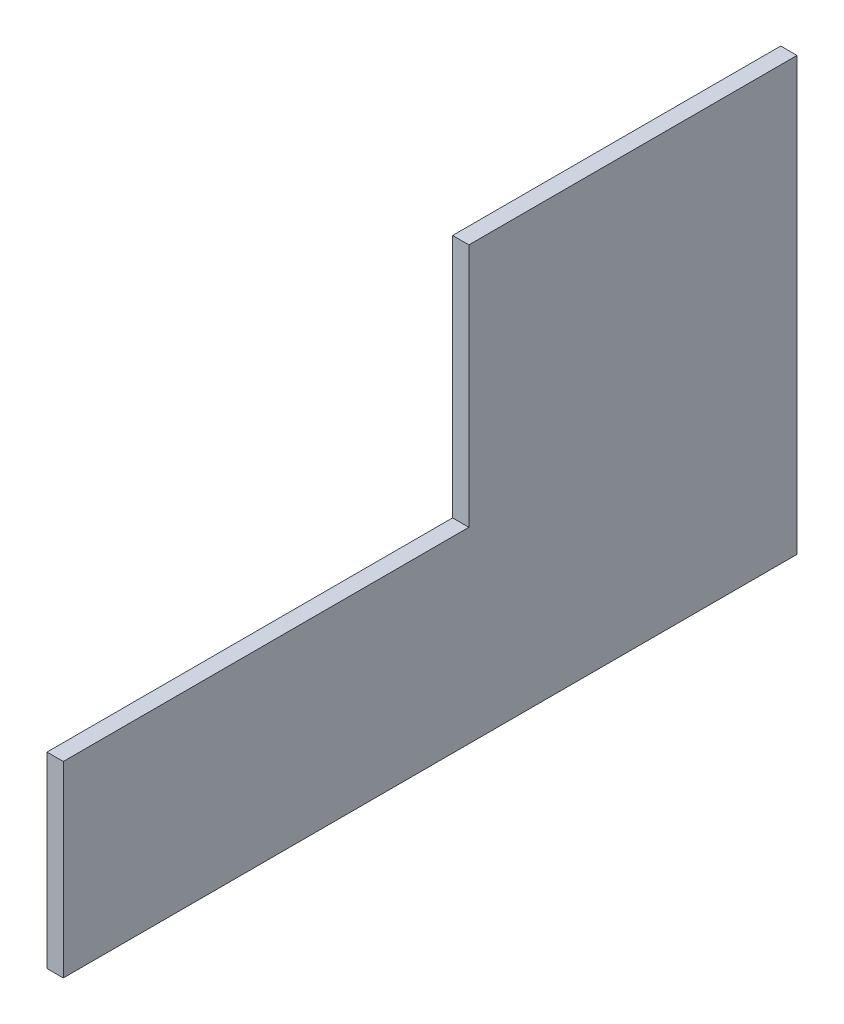
ISO-10303-21;
HEADER;
FILE_DESCRIPTION(('STEP AP214'),'2;1');
FILE_NAME('part.step','',(''),(''),'','','');
FILE_SCHEMA(('AUTOMOTIVE_DESIGN { 1 0 10303 214 1 1 1 1 }'));
ENDSEC;
DATA;
#1=APPLICATION_CONTEXT('core data for automotive mechanical design processes');
#2=APPLICATION_PROTOCOL_DEFINITION('international standard','automotive_design',2000,#1);
#3=PRODUCT_CONTEXT('',#1,'mechanical');
#4=PRODUCT('Part','Part','',(#3));
#5=PRODUCT_RELATED_PRODUCT_CATEGORY('part','',(#4));
#6=PRODUCT_DEFINITION_FORMATION('','',#4);
#7=PRODUCT_DEFINITION_CONTEXT('part definition',#1,'design');
#8=PRODUCT_DEFINITION('design','',#6,#7);
#9=PRODUCT_DEFINITION_SHAPE('','',#8);
#10=(LENGTH_UNIT() NAMED_UNIT(*) SI_UNIT(.MILLI.,.METRE.));
#11=(NAMED_UNIT(*) PLANE_ANGLE_UNIT() SI_UNIT($,.RADIAN.));
#12=(NAMED_UNIT(*) SI_UNIT($,.STERADIAN.) SOLID_ANGLE_UNIT());
#13=UNCERTAINTY_MEASURE_WITH_UNIT(LENGTH_MEASURE(1.E-05),#10,'distance_accuracy_value','');
#14=(GEOMETRIC_REPRESENTATION_CONTEXT(3) GLOBAL_UNCERTAINTY_ASSIGNED_CONTEXT((#13)) GLOBAL_UNIT_ASSIGNED_CONTEXT((#10,
#11,#12)) REPRESENTATION_CONTEXT('',''));
#15=CARTESIAN_POINT('',(0.,0.,0.));
#16=DIRECTION('',(0.,0.,1.));
#17=DIRECTION('',(1.,0.,0.));
#18=AXIS2_PLACEMENT_3D('',#15,#16,#17);
#19=CARTESIAN_POINT('',(-4.,-53.,0.));
#20=DIRECTION('',(0.,-1.,0.));
#21=DIRECTION('',(0.,0.,-1.));
#22=AXIS2_PLACEMENT_3D('',#19,#20,#21);
#23=PLANE('',#22);
#24=DIRECTION('',(0.,0.,-1.));
#25=VECTOR('',#24,1.);
#26=CARTESIAN_POINT('',(0.,-53.,0.));
#27=LINE('',#26,#25);
#28=CARTESIAN_POINT('',(0.,-53.,90.));
#29=VERTEX_POINT('',#28);
#30=CARTESIAN_POINT('',(0.,-53.,-90.));
#31=VERTEX_POINT('',#30);
#32=EDGE_CURVE('E123',#29,#31,#27,.T.);
#33=ORIENTED_EDGE('',*,*,#32,.F.);
#34=DIRECTION('',(1.,0.,0.));
#35=VECTOR('',#34,1.);
#36=CARTESIAN_POINT('',(-4.,-53.,90.));
#37=LINE('',#36,#35);
#38=CARTESIAN_POINT('',(-4.,-53.,90.));
#39=VERTEX_POINT('',#38);
#40=EDGE_CURVE('E12',#39,#29,#37,.T.);
#41=ORIENTED_EDGE('',*,*,#40,.F.);
#42=DIRECTION('',(0.,0.,-1.));
#43=VECTOR('',#42,1.);
#44=CARTESIAN_POINT('',(-4.,-53.,0.));
#45=LINE('',#44,#43);
#46=CARTESIAN_POINT('',(-4.,-53.,-90.));
#47=VERTEX_POINT('',#46);
#48=EDGE_CURVE('E144',#39,#47,#45,.T.);
#49=ORIENTED_EDGE('',*,*,#48,.T.);
#50=DIRECTION('',(1.,0.,0.));
#51=VECTOR('',#50,1.);
#52=CARTESIAN_POINT('',(-4.,-53.,-90.));
#53=LINE('',#52,#51);
#54=EDGE_CURVE('E44',#47,#31,#53,.T.);
#55=ORIENTED_EDGE('',*,*,#54,.T.);
#56=EDGE_LOOP('',(#33,#41,#49,#55));
#57=FACE_BOUND('',#56,.T.);
#58=ADVANCED_FACE('F41',(#57),#23,.T.);
#59=CARTESIAN_POINT('',(-4.,0.,90.));
#60=DIRECTION('',(0.,0.,1.));
#61=DIRECTION('',(1.,0.,0.));
#62=AXIS2_PLACEMENT_3D('',#59,#60,#61);
#63=PLANE('',#62);
#64=DIRECTION('',(0.,-1.,0.));
#65=VECTOR('',#64,1.);
#66=CARTESIAN_POINT('',(0.,0.,90.));
#67=LINE('',#66,#65);
#68=CARTESIAN_POINT('',(0.,-7.00000000000002,90.));
#69=VERTEX_POINT('',#68);
#70=EDGE_CURVE('E141',#69,#29,#67,.T.);
#71=ORIENTED_EDGE('',*,*,#70,.F.);
#72=DIRECTION('',(1.,0.,0.));
#73=VECTOR('',#72,1.);
#74=CARTESIAN_POINT('',(-4.,-7.00000000000002,90.));
#75=LINE('',#74,#73);
#76=CARTESIAN_POINT('',(-4.,-7.00000000000002,90.));
#77=VERTEX_POINT('',#76);
#78=EDGE_CURVE('E50',#77,#69,#75,.T.);
#79=ORIENTED_EDGE('',*,*,#78,.F.);
#80=DIRECTION('',(0.,-1.,0.));
#81=VECTOR('',#80,1.);
#82=CARTESIAN_POINT('',(-4.,0.,90.));
#83=LINE('',#82,#81);
#84=EDGE_CURVE('E105',#77,#39,#83,.T.);
#85=ORIENTED_EDGE('',*,*,#84,.T.);
#86=ORIENTED_EDGE('',*,*,#40,.T.);
#87=EDGE_LOOP('',(#71,#79,#85,#86));
#88=FACE_BOUND('',#87,.T.);
#89=ADVANCED_FACE('F157',(#88),#63,.T.);
#90=CARTESIAN_POINT('',(-4.,-7.00000000000002,0.));
#91=DIRECTION('',(0.,-1.,0.));
#92=DIRECTION('',(0.,0.,-1.));
#93=AXIS2_PLACEMENT_3D('',#90,#91,#92);
#94=PLANE('',#93);
#95=DIRECTION('',(0.,0.,-1.));
#96=VECTOR('',#95,1.);
#97=CARTESIAN_POINT('',(0.,-7.00000000000002,0.));
#98=LINE('',#97,#96);
#99=CARTESIAN_POINT('',(0.,-7.00000000000002,-9.50000000000004));
#100=VERTEX_POINT('',#99);
#101=EDGE_CURVE('E109',#69,#100,#98,.T.);
#102=ORIENTED_EDGE('',*,*,#101,.T.);
#103=DIRECTION('',(1.,0.,0.));
#104=VECTOR('',#103,1.);
#105=CARTESIAN_POINT('',(-4.,-7.00000000000002,-9.50000000000004));
#106=LINE('',#105,#104);
#107=CARTESIAN_POINT('',(-4.,-7.00000000000002,-9.50000000000004));
#108=VERTEX_POINT('',#107);
#109=EDGE_CURVE('E107',#108,#100,#106,.T.);
#110=ORIENTED_EDGE('',*,*,#109,.F.);
#111=DIRECTION('',(0.,0.,-1.));
#112=VECTOR('',#111,1.);
#113=CARTESIAN_POINT('',(-4.,-7.00000000000002,0.));
#114=LINE('',#113,#112);
#115=EDGE_CURVE('E100',#77,#108,#114,.T.);
#116=ORIENTED_EDGE('',*,*,#115,.F.);
#117=ORIENTED_EDGE('',*,*,#78,.T.);
#118=EDGE_LOOP('',(#102,#110,#116,#117));
#119=FACE_BOUND('',#118,.T.);
#120=ADVANCED_FACE('F108',(#119),#94,.F.);
#121=CARTESIAN_POINT('',(-4.,0.,-9.50000000000003));
#122=DIRECTION('',(0.,0.,1.));
#123=DIRECTION('',(0.,-1.,0.));
#124=AXIS2_PLACEMENT_3D('',#121,#122,#123);
#125=PLANE('',#124);
#126=DIRECTION('',(0.,-1.,0.));
#127=VECTOR('',#126,1.);
#128=CARTESIAN_POINT('',(0.,0.,-9.50000000000003));
#129=LINE('',#128,#127);
#130=CARTESIAN_POINT('',(0.,53.,-9.50000000000001));
#131=VERTEX_POINT('',#130);
#132=EDGE_CURVE('E137',#131,#100,#129,.T.);
#133=ORIENTED_EDGE('',*,*,#132,.F.);
#134=DIRECTION('',(1.,0.,0.));
#135=VECTOR('',#134,1.);
#136=CARTESIAN_POINT('',(-4.,53.,-9.50000000000001));
#137=LINE('',#136,#135);
#138=CARTESIAN_POINT('',(-4.,53.,-9.50000000000001));
#139=VERTEX_POINT('',#138);
#140=EDGE_CURVE('E113',#139,#131,#137,.T.);
#141=ORIENTED_EDGE('',*,*,#140,.F.);
#142=DIRECTION('',(0.,-1.,0.));
#143=VECTOR('',#142,1.);
#144=CARTESIAN_POINT('',(-4.,0.,-9.50000000000003));
#145=LINE('',#144,#143);
#146=EDGE_CURVE('E104',#139,#108,#145,.T.);
#147=ORIENTED_EDGE('',*,*,#146,.T.);
#148=ORIENTED_EDGE('',*,*,#109,.T.);
#149=EDGE_LOOP('',(#133,#141,#147,#148));
#150=FACE_BOUND('',#149,.T.);
#151=ADVANCED_FACE('F115',(#150),#125,.T.);
#152=CARTESIAN_POINT('',(-4.,53.,0.));
#153=DIRECTION('',(0.,-1.,0.));
#154=DIRECTION('',(0.,0.,-1.));
#155=AXIS2_PLACEMENT_3D('',#152,#153,#154);
#156=PLANE('',#155);
#157=DIRECTION('',(0.,0.,-1.));
#158=VECTOR('',#157,1.);
#159=CARTESIAN_POINT('',(0.,53.,0.));
#160=LINE('',#159,#158);
#161=CARTESIAN_POINT('',(0.,53.,-90.));
#162=VERTEX_POINT('',#161);
#163=EDGE_CURVE('E135',#131,#162,#160,.T.);
#164=ORIENTED_EDGE('',*,*,#163,.T.);
#165=DIRECTION('',(1.,0.,0.));
#166=VECTOR('',#165,1.);
#167=CARTESIAN_POINT('',(-4.,53.,-90.));
#168=LINE('',#167,#166);
#169=CARTESIAN_POINT('',(-4.,53.,-90.));
#170=VERTEX_POINT('',#169);
#171=EDGE_CURVE('E147',#170,#162,#168,.T.);
#172=ORIENTED_EDGE('',*,*,#171,.F.);
#173=DIRECTION('',(0.,0.,-1.));
#174=VECTOR('',#173,1.);
#175=CARTESIAN_POINT('',(-4.,53.,0.));
#176=LINE('',#175,#174);
#177=EDGE_CURVE('E117',#139,#170,#176,.T.);
#178=ORIENTED_EDGE('',*,*,#177,.F.);
#179=ORIENTED_EDGE('',*,*,#140,.T.);
#180=EDGE_LOOP('',(#164,#172,#178,#179));
#181=FACE_BOUND('',#180,.T.);
#182=ADVANCED_FACE('F170',(#181),#156,.F.);
#183=CARTESIAN_POINT('',(-4.,0.,-90.));
#184=DIRECTION('',(0.,0.,1.));
#185=DIRECTION('',(1.,0.,0.));
#186=AXIS2_PLACEMENT_3D('',#183,#184,#185);
#187=PLANE('',#186);
#188=DIRECTION('',(0.,-1.,0.));
#189=VECTOR('',#188,1.);
#190=CARTESIAN_POINT('',(0.,0.,-90.));
#191=LINE('',#190,#189);
#192=EDGE_CURVE('E127',#162,#31,#191,.T.);
#193=ORIENTED_EDGE('',*,*,#192,.T.);
#194=ORIENTED_EDGE('',*,*,#54,.F.);
#195=DIRECTION('',(0.,-1.,0.));
#196=VECTOR('',#195,1.);
#197=CARTESIAN_POINT('',(-4.,0.,-90.));
#198=LINE('',#197,#196);
#199=EDGE_CURVE('E91',#170,#47,#198,.T.);
#200=ORIENTED_EDGE('',*,*,#199,.F.);
#201=ORIENTED_EDGE('',*,*,#171,.T.);
#202=EDGE_LOOP('',(#193,#194,#200,#201));
#203=FACE_BOUND('',#202,.T.);
#204=ADVANCED_FACE('F153',(#203),#187,.F.);
#205=CARTESIAN_POINT('',(-4.,0.,0.));
#206=DIRECTION('',(1.,0.,0.));
#207=DIRECTION('',(0.,0.,-1.));
#208=AXIS2_PLACEMENT_3D('',#205,#206,#207);
#209=PLANE('',#208);
#210=ORIENTED_EDGE('',*,*,#48,.F.);
#211=ORIENTED_EDGE('',*,*,#84,.F.);
#212=ORIENTED_EDGE('',*,*,#115,.T.);
#213=ORIENTED_EDGE('',*,*,#146,.F.);
#214=ORIENTED_EDGE('',*,*,#177,.T.);
#215=ORIENTED_EDGE('',*,*,#199,.T.);
#216=EDGE_LOOP('',(#210,#211,#212,#213,#214,#215));
#217=FACE_BOUND('',#216,.T.);
#218=ADVANCED_FACE('F102',(#217),#209,.F.);
#219=CARTESIAN_POINT('',(0.,0.,0.));
#220=DIRECTION('',(1.,0.,0.));
#221=DIRECTION('',(0.,0.,-1.));
#222=AXIS2_PLACEMENT_3D('',#219,#220,#221);
#223=PLANE('',#222);
#224=ORIENTED_EDGE('',*,*,#32,.T.);
#225=ORIENTED_EDGE('',*,*,#192,.F.);
#226=ORIENTED_EDGE('',*,*,#163,.F.);
#227=ORIENTED_EDGE('',*,*,#132,.T.);
#228=ORIENTED_EDGE('',*,*,#101,.F.);
#229=ORIENTED_EDGE('',*,*,#70,.T.);
#230=EDGE_LOOP('',(#224,#225,#226,#227,#228,#229));
#231=FACE_BOUND('',#230,.T.);
#232=ADVANCED_FACE('F156',(#231),#223,.T.);
#233=CLOSED_SHELL('',(#58,#89,#120,#151,#182,#204,#218,#232));
#234=MANIFOLD_SOLID_BREP('B2',#233);
#235=ADVANCED_BREP_SHAPE_REPRESENTATION('',(#18,#234),#14);
#236=SHAPE_DEFINITION_REPRESENTATION(#9,#235);
ENDSEC;
END-ISO-10303-21;
